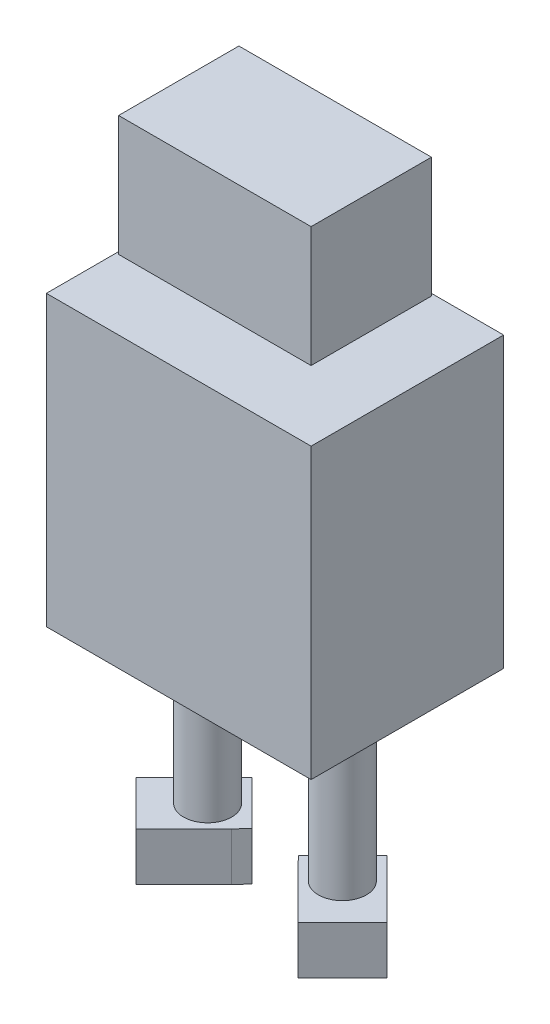
ISO-10303-21;
HEADER;
FILE_DESCRIPTION(('STEP AP214'),'2;1');
FILE_NAME('part.step','',(''),(''),'','','');
FILE_SCHEMA(('AUTOMOTIVE_DESIGN { 1 0 10303 214 1 1 1 1 }'));
ENDSEC;
DATA;
#1=APPLICATION_CONTEXT('core data for automotive mechanical design processes');
#2=APPLICATION_PROTOCOL_DEFINITION('international standard','automotive_design',2000,#1);
#3=PRODUCT_CONTEXT('',#1,'mechanical');
#4=PRODUCT('Part','Part','',(#3));
#5=PRODUCT_RELATED_PRODUCT_CATEGORY('part','',(#4));
#6=PRODUCT_DEFINITION_FORMATION('','',#4);
#7=PRODUCT_DEFINITION_CONTEXT('part definition',#1,'design');
#8=PRODUCT_DEFINITION('design','',#6,#7);
#9=PRODUCT_DEFINITION_SHAPE('','',#8);
#10=(LENGTH_UNIT() NAMED_UNIT(*) SI_UNIT(.MILLI.,.METRE.));
#11=(NAMED_UNIT(*) PLANE_ANGLE_UNIT() SI_UNIT($,.RADIAN.));
#12=(NAMED_UNIT(*) SI_UNIT($,.STERADIAN.) SOLID_ANGLE_UNIT());
#13=UNCERTAINTY_MEASURE_WITH_UNIT(LENGTH_MEASURE(1.E-05),#10,'distance_accuracy_value','');
#14=(GEOMETRIC_REPRESENTATION_CONTEXT(3) GLOBAL_UNCERTAINTY_ASSIGNED_CONTEXT((#13)) GLOBAL_UNIT_ASSIGNED_CONTEXT((#10,
#11,#12)) REPRESENTATION_CONTEXT('',''));
#15=CARTESIAN_POINT('',(0.,0.,0.));
#16=DIRECTION('',(0.,0.,1.));
#17=DIRECTION('',(1.,0.,0.));
#18=AXIS2_PLACEMENT_3D('',#15,#16,#17);
#19=CARTESIAN_POINT('',(-27.5,-30.,40.));
#20=DIRECTION('',(0.,1.,0.));
#21=DIRECTION('',(0.,0.,1.));
#22=AXIS2_PLACEMENT_3D('',#19,#20,#21);
#23=PLANE('',#22);
#24=CARTESIAN_POINT('',(-14.,-30.,20.));
#25=DIRECTION('',(0.,1.,0.));
#26=DIRECTION('',(0.,0.,1.));
#27=AXIS2_PLACEMENT_3D('',#24,#25,#26);
#28=CIRCLE('',#27,5.);
#29=CARTESIAN_POINT('',(-14.,-30.,25.));
#30=VERTEX_POINT('',#29);
#31=EDGE_CURVE('E42',#30,#30,#28,.F.);
#32=ORIENTED_EDGE('',*,*,#31,.F.);
#33=EDGE_LOOP('',(#32));
#34=FACE_BOUND('',#33,.T.);
#35=DIRECTION('',(1.,0.,0.));
#36=VECTOR('',#35,1.);
#37=CARTESIAN_POINT('',(-27.5,-30.,0.));
#38=LINE('',#37,#36);
#39=CARTESIAN_POINT('',(-27.5,-30.,0.));
#40=VERTEX_POINT('',#39);
#41=CARTESIAN_POINT('',(27.5,-30.,0.));
#42=VERTEX_POINT('',#41);
#43=EDGE_CURVE('E74',#40,#42,#38,.T.);
#44=ORIENTED_EDGE('',*,*,#43,.T.);
#45=DIRECTION('',(0.,0.,-1.));
#46=VECTOR('',#45,1.);
#47=CARTESIAN_POINT('',(27.5,-30.,40.));
#48=LINE('',#47,#46);
#49=CARTESIAN_POINT('',(27.5,-30.,40.));
#50=VERTEX_POINT('',#49);
#51=EDGE_CURVE('E297',#50,#42,#48,.T.);
#52=ORIENTED_EDGE('',*,*,#51,.F.);
#53=DIRECTION('',(1.,0.,0.));
#54=VECTOR('',#53,1.);
#55=CARTESIAN_POINT('',(-27.5,-30.,40.));
#56=LINE('',#55,#54);
#57=CARTESIAN_POINT('',(-27.5,-30.,40.));
#58=VERTEX_POINT('',#57);
#59=EDGE_CURVE('E50',#58,#50,#56,.T.);
#60=ORIENTED_EDGE('',*,*,#59,.F.);
#61=DIRECTION('',(0.,0.,-1.));
#62=VECTOR('',#61,1.);
#63=CARTESIAN_POINT('',(-27.5,-30.,40.));
#64=LINE('',#63,#62);
#65=EDGE_CURVE('E305',#58,#40,#64,.T.);
#66=ORIENTED_EDGE('',*,*,#65,.T.);
#67=EDGE_LOOP('',(#44,#52,#60,#66));
#68=FACE_BOUND('',#67,.T.);
#69=CARTESIAN_POINT('',(14.,-30.,20.));
#70=DIRECTION('',(0.,1.,0.));
#71=DIRECTION('',(0.,0.,1.));
#72=AXIS2_PLACEMENT_3D('',#69,#70,#71);
#73=CIRCLE('',#72,5.);
#74=CARTESIAN_POINT('',(14.,-30.,25.));
#75=VERTEX_POINT('',#74);
#76=EDGE_CURVE('E11',#75,#75,#73,.F.);
#77=ORIENTED_EDGE('',*,*,#76,.F.);
#78=EDGE_LOOP('',(#77));
#79=FACE_BOUND('',#78,.T.);
#80=ADVANCED_FACE('F33',(#34,#68,#79),#23,.F.);
#81=CARTESIAN_POINT('',(-27.5,30.,40.));
#82=DIRECTION('',(0.,-1.,0.));
#83=DIRECTION('',(0.,0.,-1.));
#84=AXIS2_PLACEMENT_3D('',#81,#82,#83);
#85=PLANE('',#84);
#86=DIRECTION('',(-1.,0.,0.));
#87=VECTOR('',#86,1.);
#88=CARTESIAN_POINT('',(-27.5,30.,0.));
#89=LINE('',#88,#87);
#90=CARTESIAN_POINT('',(27.5,30.,0.));
#91=VERTEX_POINT('',#90);
#92=CARTESIAN_POINT('',(-27.5,30.,0.));
#93=VERTEX_POINT('',#92);
#94=EDGE_CURVE('E300',#91,#93,#89,.T.);
#95=ORIENTED_EDGE('',*,*,#94,.T.);
#96=DIRECTION('',(0.,0.,-1.));
#97=VECTOR('',#96,1.);
#98=CARTESIAN_POINT('',(-27.5,30.,40.));
#99=LINE('',#98,#97);
#100=CARTESIAN_POINT('',(-27.5,30.,40.));
#101=VERTEX_POINT('',#100);
#102=EDGE_CURVE('E307',#101,#93,#99,.T.);
#103=ORIENTED_EDGE('',*,*,#102,.F.);
#104=DIRECTION('',(-1.,0.,0.));
#105=VECTOR('',#104,1.);
#106=CARTESIAN_POINT('',(-27.5,30.,40.));
#107=LINE('',#106,#105);
#108=CARTESIAN_POINT('',(27.5,30.,40.));
#109=VERTEX_POINT('',#108);
#110=EDGE_CURVE('E82',#109,#101,#107,.T.);
#111=ORIENTED_EDGE('',*,*,#110,.F.);
#112=DIRECTION('',(0.,0.,-1.));
#113=VECTOR('',#112,1.);
#114=CARTESIAN_POINT('',(27.5,30.,40.));
#115=LINE('',#114,#113);
#116=EDGE_CURVE('E309',#109,#91,#115,.T.);
#117=ORIENTED_EDGE('',*,*,#116,.T.);
#118=EDGE_LOOP('',(#95,#103,#111,#117));
#119=FACE_BOUND('',#118,.T.);
#120=CARTESIAN_POINT('',(0.,30.,20.));
#121=DIRECTION('',(0.,-1.,0.));
#122=DIRECTION('',(0.,0.,-1.));
#123=AXIS2_PLACEMENT_3D('',#120,#121,#122);
#124=CIRCLE('',#123,4.);
#125=CARTESIAN_POINT('',(0.,30.,16.));
#126=VERTEX_POINT('',#125);
#127=EDGE_CURVE('E311',#126,#126,#124,.F.);
#128=ORIENTED_EDGE('',*,*,#127,.F.);
#129=EDGE_LOOP('',(#128));
#130=FACE_BOUND('',#129,.T.);
#131=ADVANCED_FACE('F319',(#119,#130),#85,.F.);
#132=CARTESIAN_POINT('',(27.5,-30.,40.));
#133=DIRECTION('',(-1.,0.,0.));
#134=DIRECTION('',(0.,0.,1.));
#135=AXIS2_PLACEMENT_3D('',#132,#133,#134);
#136=PLANE('',#135);
#137=DIRECTION('',(0.,1.,0.));
#138=VECTOR('',#137,1.);
#139=CARTESIAN_POINT('',(27.5,-30.,0.));
#140=LINE('',#139,#138);
#141=EDGE_CURVE('E290',#42,#91,#140,.T.);
#142=ORIENTED_EDGE('',*,*,#141,.T.);
#143=ORIENTED_EDGE('',*,*,#116,.F.);
#144=DIRECTION('',(0.,1.,0.));
#145=VECTOR('',#144,1.);
#146=CARTESIAN_POINT('',(27.5,-30.,40.));
#147=LINE('',#146,#145);
#148=EDGE_CURVE('E291',#50,#109,#147,.T.);
#149=ORIENTED_EDGE('',*,*,#148,.F.);
#150=ORIENTED_EDGE('',*,*,#51,.T.);
#151=EDGE_LOOP('',(#142,#143,#149,#150));
#152=FACE_BOUND('',#151,.T.);
#153=ADVANCED_FACE('F35',(#152),#136,.F.);
#154=CARTESIAN_POINT('',(-27.5,-30.,40.));
#155=DIRECTION('',(1.,0.,0.));
#156=DIRECTION('',(0.,0.,-1.));
#157=AXIS2_PLACEMENT_3D('',#154,#155,#156);
#158=PLANE('',#157);
#159=DIRECTION('',(0.,-1.,0.));
#160=VECTOR('',#159,1.);
#161=CARTESIAN_POINT('',(-27.5,-30.,0.));
#162=LINE('',#161,#160);
#163=EDGE_CURVE('E68',#93,#40,#162,.T.);
#164=ORIENTED_EDGE('',*,*,#163,.T.);
#165=ORIENTED_EDGE('',*,*,#65,.F.);
#166=DIRECTION('',(0.,-1.,0.));
#167=VECTOR('',#166,1.);
#168=CARTESIAN_POINT('',(-27.5,-30.,40.));
#169=LINE('',#168,#167);
#170=EDGE_CURVE('E294',#101,#58,#169,.T.);
#171=ORIENTED_EDGE('',*,*,#170,.F.);
#172=ORIENTED_EDGE('',*,*,#102,.T.);
#173=EDGE_LOOP('',(#164,#165,#171,#172));
#174=FACE_BOUND('',#173,.T.);
#175=ADVANCED_FACE('F374',(#174),#158,.F.);
#176=CARTESIAN_POINT('',(27.5,30.,40.));
#177=DIRECTION('',(0.,0.,-1.));
#178=DIRECTION('',(-1.,0.,0.));
#179=AXIS2_PLACEMENT_3D('',#176,#177,#178);
#180=PLANE('',#179);
#181=ORIENTED_EDGE('',*,*,#148,.T.);
#182=ORIENTED_EDGE('',*,*,#110,.T.);
#183=ORIENTED_EDGE('',*,*,#170,.T.);
#184=ORIENTED_EDGE('',*,*,#59,.T.);
#185=EDGE_LOOP('',(#181,#182,#183,#184));
#186=FACE_BOUND('',#185,.T.);
#187=ADVANCED_FACE('F371',(#186),#180,.F.);
#188=CARTESIAN_POINT('',(27.5,30.,0.));
#189=DIRECTION('',(0.,0.,-1.));
#190=DIRECTION('',(-1.,0.,0.));
#191=AXIS2_PLACEMENT_3D('',#188,#189,#190);
#192=PLANE('',#191);
#193=ORIENTED_EDGE('',*,*,#141,.F.);
#194=ORIENTED_EDGE('',*,*,#43,.F.);
#195=ORIENTED_EDGE('',*,*,#163,.F.);
#196=ORIENTED_EDGE('',*,*,#94,.F.);
#197=EDGE_LOOP('',(#193,#194,#195,#196));
#198=FACE_BOUND('',#197,.T.);
#199=ADVANCED_FACE('F369',(#198),#192,.T.);
#200=CARTESIAN_POINT('',(0.,37.,20.));
#201=DIRECTION('',(0.,-1.,0.));
#202=DIRECTION('',(0.,0.,-1.));
#203=AXIS2_PLACEMENT_3D('',#200,#201,#202);
#204=CYLINDRICAL_SURFACE('',#203,4.);
#205=CARTESIAN_POINT('',(0.,37.,20.));
#206=DIRECTION('',(0.,1.,0.));
#207=DIRECTION('',(0.,0.,1.));
#208=AXIS2_PLACEMENT_3D('',#205,#206,#207);
#209=CIRCLE('',#208,4.);
#210=CARTESIAN_POINT('',(0.,37.,24.));
#211=VERTEX_POINT('',#210);
#212=EDGE_CURVE('E287',#211,#211,#209,.T.);
#213=ORIENTED_EDGE('',*,*,#212,.F.);
#214=EDGE_LOOP('',(#213));
#215=FACE_BOUND('',#214,.T.);
#216=ORIENTED_EDGE('',*,*,#127,.T.);
#217=EDGE_LOOP('',(#216));
#218=FACE_BOUND('',#217,.T.);
#219=ADVANCED_FACE('F351',(#215,#218),#204,.T.);
#220=CARTESIAN_POINT('',(-20.,37.,32.5));
#221=DIRECTION('',(0.,-1.,0.));
#222=DIRECTION('',(0.,0.,-1.));
#223=AXIS2_PLACEMENT_3D('',#220,#221,#222);
#224=PLANE('',#223);
#225=DIRECTION('',(0.,0.,1.));
#226=VECTOR('',#225,1.);
#227=CARTESIAN_POINT('',(-20.,37.,7.50000000000001));
#228=LINE('',#227,#226);
#229=CARTESIAN_POINT('',(-20.,37.,7.50000000000001));
#230=VERTEX_POINT('',#229);
#231=CARTESIAN_POINT('',(-20.,37.,32.5));
#232=VERTEX_POINT('',#231);
#233=EDGE_CURVE('E257',#230,#232,#228,.T.);
#234=ORIENTED_EDGE('',*,*,#233,.F.);
#235=DIRECTION('',(-1.,0.,0.));
#236=VECTOR('',#235,1.);
#237=CARTESIAN_POINT('',(20.,37.,7.50000000000001));
#238=LINE('',#237,#236);
#239=CARTESIAN_POINT('',(20.,37.,7.50000000000001));
#240=VERTEX_POINT('',#239);
#241=EDGE_CURVE('E262',#240,#230,#238,.T.);
#242=ORIENTED_EDGE('',*,*,#241,.F.);
#243=DIRECTION('',(0.,0.,-1.));
#244=VECTOR('',#243,1.);
#245=CARTESIAN_POINT('',(20.,37.,7.50000000000001));
#246=LINE('',#245,#244);
#247=CARTESIAN_POINT('',(20.,37.,32.5));
#248=VERTEX_POINT('',#247);
#249=EDGE_CURVE('E273',#248,#240,#246,.T.);
#250=ORIENTED_EDGE('',*,*,#249,.F.);
#251=DIRECTION('',(1.,0.,0.));
#252=VECTOR('',#251,1.);
#253=CARTESIAN_POINT('',(20.,37.,32.5));
#254=LINE('',#253,#252);
#255=EDGE_CURVE('E271',#232,#248,#254,.T.);
#256=ORIENTED_EDGE('',*,*,#255,.F.);
#257=EDGE_LOOP('',(#234,#242,#250,#256));
#258=FACE_BOUND('',#257,.T.);
#259=ORIENTED_EDGE('',*,*,#212,.T.);
#260=EDGE_LOOP('',(#259));
#261=FACE_BOUND('',#260,.T.);
#262=ADVANCED_FACE('F347',(#258,#261),#224,.T.);
#263=CARTESIAN_POINT('',(-20.,62.,7.50000000000001));
#264=DIRECTION('',(1.,0.,0.));
#265=DIRECTION('',(0.,0.,-1.));
#266=AXIS2_PLACEMENT_3D('',#263,#264,#265);
#267=PLANE('',#266);
#268=ORIENTED_EDGE('',*,*,#233,.T.);
#269=DIRECTION('',(0.,-1.,0.));
#270=VECTOR('',#269,1.);
#271=CARTESIAN_POINT('',(-20.,62.,32.5));
#272=LINE('',#271,#270);
#273=CARTESIAN_POINT('',(-20.,62.,32.5));
#274=VERTEX_POINT('',#273);
#275=EDGE_CURVE('E284',#274,#232,#272,.T.);
#276=ORIENTED_EDGE('',*,*,#275,.F.);
#277=DIRECTION('',(0.,0.,1.));
#278=VECTOR('',#277,1.);
#279=CARTESIAN_POINT('',(-20.,62.,7.50000000000001));
#280=LINE('',#279,#278);
#281=CARTESIAN_POINT('',(-20.,62.,7.50000000000001));
#282=VERTEX_POINT('',#281);
#283=EDGE_CURVE('E258',#282,#274,#280,.T.);
#284=ORIENTED_EDGE('',*,*,#283,.F.);
#285=DIRECTION('',(0.,-1.,0.));
#286=VECTOR('',#285,1.);
#287=CARTESIAN_POINT('',(-20.,62.,7.50000000000001));
#288=LINE('',#287,#286);
#289=EDGE_CURVE('E268',#282,#230,#288,.T.);
#290=ORIENTED_EDGE('',*,*,#289,.T.);
#291=EDGE_LOOP('',(#268,#276,#284,#290));
#292=FACE_BOUND('',#291,.T.);
#293=ADVANCED_FACE('F350',(#292),#267,.F.);
#294=CARTESIAN_POINT('',(20.,62.,32.5));
#295=DIRECTION('',(0.,0.,-1.));
#296=DIRECTION('',(-1.,0.,0.));
#297=AXIS2_PLACEMENT_3D('',#294,#295,#296);
#298=PLANE('',#297);
#299=ORIENTED_EDGE('',*,*,#255,.T.);
#300=DIRECTION('',(0.,-1.,0.));
#301=VECTOR('',#300,1.);
#302=CARTESIAN_POINT('',(20.,62.,32.5));
#303=LINE('',#302,#301);
#304=CARTESIAN_POINT('',(20.,62.,32.5));
#305=VERTEX_POINT('',#304);
#306=EDGE_CURVE('E281',#305,#248,#303,.T.);
#307=ORIENTED_EDGE('',*,*,#306,.F.);
#308=DIRECTION('',(1.,0.,0.));
#309=VECTOR('',#308,1.);
#310=CARTESIAN_POINT('',(20.,62.,32.5));
#311=LINE('',#310,#309);
#312=EDGE_CURVE('E261',#274,#305,#311,.T.);
#313=ORIENTED_EDGE('',*,*,#312,.F.);
#314=ORIENTED_EDGE('',*,*,#275,.T.);
#315=EDGE_LOOP('',(#299,#307,#313,#314));
#316=FACE_BOUND('',#315,.T.);
#317=ADVANCED_FACE('F359',(#316),#298,.F.);
#318=CARTESIAN_POINT('',(20.,62.,7.50000000000001));
#319=DIRECTION('',(-1.,0.,0.));
#320=DIRECTION('',(0.,0.,1.));
#321=AXIS2_PLACEMENT_3D('',#318,#319,#320);
#322=PLANE('',#321);
#323=ORIENTED_EDGE('',*,*,#249,.T.);
#324=DIRECTION('',(0.,-1.,0.));
#325=VECTOR('',#324,1.);
#326=CARTESIAN_POINT('',(20.,62.,7.50000000000001));
#327=LINE('',#326,#325);
#328=CARTESIAN_POINT('',(20.,62.,7.50000000000001));
#329=VERTEX_POINT('',#328);
#330=EDGE_CURVE('E278',#329,#240,#327,.T.);
#331=ORIENTED_EDGE('',*,*,#330,.F.);
#332=DIRECTION('',(0.,0.,-1.));
#333=VECTOR('',#332,1.);
#334=CARTESIAN_POINT('',(20.,62.,7.50000000000001));
#335=LINE('',#334,#333);
#336=EDGE_CURVE('E264',#305,#329,#335,.T.);
#337=ORIENTED_EDGE('',*,*,#336,.F.);
#338=ORIENTED_EDGE('',*,*,#306,.T.);
#339=EDGE_LOOP('',(#323,#331,#337,#338));
#340=FACE_BOUND('',#339,.T.);
#341=ADVANCED_FACE('F355',(#340),#322,.F.);
#342=CARTESIAN_POINT('',(20.,62.,7.50000000000001));
#343=DIRECTION('',(0.,0.,1.));
#344=DIRECTION('',(1.,0.,0.));
#345=AXIS2_PLACEMENT_3D('',#342,#343,#344);
#346=PLANE('',#345);
#347=ORIENTED_EDGE('',*,*,#241,.T.);
#348=ORIENTED_EDGE('',*,*,#289,.F.);
#349=DIRECTION('',(-1.,0.,0.));
#350=VECTOR('',#349,1.);
#351=CARTESIAN_POINT('',(20.,62.,7.50000000000001));
#352=LINE('',#351,#350);
#353=EDGE_CURVE('E266',#329,#282,#352,.T.);
#354=ORIENTED_EDGE('',*,*,#353,.F.);
#355=ORIENTED_EDGE('',*,*,#330,.T.);
#356=EDGE_LOOP('',(#347,#348,#354,#355));
#357=FACE_BOUND('',#356,.T.);
#358=ADVANCED_FACE('F345',(#357),#346,.F.);
#359=CARTESIAN_POINT('',(-20.,62.,32.5));
#360=DIRECTION('',(0.,-1.,0.));
#361=DIRECTION('',(0.,0.,-1.));
#362=AXIS2_PLACEMENT_3D('',#359,#360,#361);
#363=PLANE('',#362);
#364=ORIENTED_EDGE('',*,*,#283,.T.);
#365=ORIENTED_EDGE('',*,*,#312,.T.);
#366=ORIENTED_EDGE('',*,*,#336,.T.);
#367=ORIENTED_EDGE('',*,*,#353,.T.);
#368=EDGE_LOOP('',(#364,#365,#366,#367));
#369=FACE_BOUND('',#368,.T.);
#370=ADVANCED_FACE('F336',(#369),#363,.F.);
#371=CARTESIAN_POINT('',(-14.,-65.,20.));
#372=DIRECTION('',(0.,1.,0.));
#373=DIRECTION('',(0.,0.,1.));
#374=AXIS2_PLACEMENT_3D('',#371,#372,#373);
#375=CYLINDRICAL_SURFACE('',#374,5.);
#376=CARTESIAN_POINT('',(-14.,-65.,20.));
#377=DIRECTION('',(0.,-1.,0.));
#378=DIRECTION('',(0.,0.,-1.));
#379=AXIS2_PLACEMENT_3D('',#376,#377,#378);
#380=CIRCLE('',#379,5.);
#381=CARTESIAN_POINT('',(-14.,-65.,15.));
#382=VERTEX_POINT('',#381);
#383=EDGE_CURVE('E254',#382,#382,#380,.T.);
#384=ORIENTED_EDGE('',*,*,#383,.F.);
#385=EDGE_LOOP('',(#384));
#386=FACE_BOUND('',#385,.T.);
#387=ORIENTED_EDGE('',*,*,#31,.T.);
#388=EDGE_LOOP('',(#387));
#389=FACE_BOUND('',#388,.T.);
#390=ADVANCED_FACE('F316',(#386,#389),#375,.T.);
#391=CARTESIAN_POINT('',(14.,-65.,20.));
#392=DIRECTION('',(0.,1.,0.));
#393=DIRECTION('',(0.,0.,1.));
#394=AXIS2_PLACEMENT_3D('',#391,#392,#393);
#395=CYLINDRICAL_SURFACE('',#394,5.);
#396=CARTESIAN_POINT('',(14.,-65.,20.));
#397=DIRECTION('',(0.,-1.,0.));
#398=DIRECTION('',(0.,0.,1.));
#399=AXIS2_PLACEMENT_3D('',#396,#397,#398);
#400=CIRCLE('',#399,5.);
#401=CARTESIAN_POINT('',(14.,-65.,25.));
#402=VERTEX_POINT('',#401);
#403=EDGE_CURVE('E251',#402,#402,#400,.T.);
#404=ORIENTED_EDGE('',*,*,#403,.F.);
#405=EDGE_LOOP('',(#404));
#406=FACE_BOUND('',#405,.T.);
#407=ORIENTED_EDGE('',*,*,#76,.T.);
#408=EDGE_LOOP('',(#407));
#409=FACE_BOUND('',#408,.T.);
#410=ADVANCED_FACE('F324',(#406,#409),#395,.T.);
#411=CARTESIAN_POINT('',(-26.0804030524489,-65.,22.8284271247462));
#412=DIRECTION('',(0.,-1.,0.));
#413=DIRECTION('',(0.,0.,-1.));
#414=AXIS2_PLACEMENT_3D('',#411,#412,#413);
#415=PLANE('',#414);
#416=DIRECTION('',(-0.707106781186546,0.,-0.707106781186549));
#417=VECTOR('',#416,1.);
#418=CARTESIAN_POINT('',(-23.9590827088893,-65.,24.9497474683058));
#419=LINE('',#418,#417);
#420=CARTESIAN_POINT('',(-16.8377623653296,-65.,32.0710678118655));
#421=VERTEX_POINT('',#420);
#422=CARTESIAN_POINT('',(-26.0804030524489,-65.,22.8284271247462));
#423=VERTEX_POINT('',#422);
#424=EDGE_CURVE('E179',#421,#423,#419,.T.);
#425=ORIENTED_EDGE('',*,*,#424,.F.);
#426=DIRECTION('',(0.707106781186548,0.,-0.707106781186547));
#427=VECTOR('',#426,1.);
#428=CARTESIAN_POINT('',(-16.8377623653296,-65.,32.0710678118655));
#429=LINE('',#428,#427);
#430=CARTESIAN_POINT('',(-6.88801489702381,-65.,22.1213203435596));
#431=VERTEX_POINT('',#430);
#432=EDGE_CURVE('E217',#421,#431,#429,.T.);
#433=ORIENTED_EDGE('',*,*,#432,.T.);
#434=DIRECTION('',(-0.68585509245863,0.,0.727738134323442));
#435=VECTOR('',#434,1.);
#436=CARTESIAN_POINT('',(-4.82954668594094,-65.,19.9371478675232));
#437=LINE('',#436,#435);
#438=CARTESIAN_POINT('',(-4.82954668594094,-65.,19.9371478675232));
#439=VERTEX_POINT('',#438);
#440=EDGE_CURVE('E233',#439,#431,#437,.T.);
#441=ORIENTED_EDGE('',*,*,#440,.F.);
#442=DIRECTION('',(0.707106781186551,0.,0.707106781186544));
#443=VECTOR('',#442,1.);
#444=CARTESIAN_POINT('',(-6.88801489702381,-65.,17.8786796564404));
#445=LINE('',#444,#443);
#446=CARTESIAN_POINT('',(-14.0093352405835,-65.,10.7573593128807));
#447=VERTEX_POINT('',#446);
#448=EDGE_CURVE('E231',#447,#439,#445,.T.);
#449=ORIENTED_EDGE('',*,*,#448,.F.);
#450=DIRECTION('',(-0.707106781186547,0.,0.707106781186548));
#451=VECTOR('',#450,1.);
#452=CARTESIAN_POINT('',(-14.0093352405835,-65.,10.7573593128807));
#453=LINE('',#452,#451);
#454=EDGE_CURVE('E229',#447,#423,#453,.T.);
#455=ORIENTED_EDGE('',*,*,#454,.T.);
#456=EDGE_LOOP('',(#425,#433,#441,#449,#455));
#457=FACE_BOUND('',#456,.T.);
#458=ORIENTED_EDGE('',*,*,#383,.T.);
#459=EDGE_LOOP('',(#458));
#460=FACE_BOUND('',#459,.T.);
#461=ADVANCED_FACE('F326',(#457,#460),#415,.F.);
#462=CARTESIAN_POINT('',(-23.9590827088893,-75.,24.9497474683058));
#463=DIRECTION('',(0.707106781186549,0.,-0.707106781186546));
#464=DIRECTION('',(-0.707106781186546,0.,-0.707106781186549));
#465=AXIS2_PLACEMENT_3D('',#462,#463,#464);
#466=PLANE('',#465);
#467=ORIENTED_EDGE('',*,*,#424,.T.);
#468=DIRECTION('',(0.,1.,0.));
#469=VECTOR('',#468,1.);
#470=CARTESIAN_POINT('',(-26.0804030524489,-75.,22.8284271247462));
#471=LINE('',#470,#469);
#472=CARTESIAN_POINT('',(-26.0804030524489,-75.,22.8284271247462));
#473=VERTEX_POINT('',#472);
#474=EDGE_CURVE('E248',#473,#423,#471,.T.);
#475=ORIENTED_EDGE('',*,*,#474,.F.);
#476=DIRECTION('',(-0.707106781186549,0.,-0.707106781186546));
#477=VECTOR('',#476,1.);
#478=CARTESIAN_POINT('',(-16.8377623653296,-75.,32.0710678118655));
#479=LINE('',#478,#477);
#480=CARTESIAN_POINT('',(-16.8377623653296,-75.,32.0710678118655));
#481=VERTEX_POINT('',#480);
#482=EDGE_CURVE('E214',#481,#473,#479,.T.);
#483=ORIENTED_EDGE('',*,*,#482,.F.);
#484=DIRECTION('',(0.,1.,0.));
#485=VECTOR('',#484,1.);
#486=CARTESIAN_POINT('',(-16.8377623653296,-75.,32.0710678118655));
#487=LINE('',#486,#485);
#488=EDGE_CURVE('E226',#481,#421,#487,.T.);
#489=ORIENTED_EDGE('',*,*,#488,.T.);
#490=EDGE_LOOP('',(#467,#475,#483,#489));
#491=FACE_BOUND('',#490,.T.);
#492=ADVANCED_FACE('F333',(#491),#466,.F.);
#493=CARTESIAN_POINT('',(-14.0093352405835,-75.,10.7573593128807));
#494=DIRECTION('',(-0.707106781186548,0.,-0.707106781186547));
#495=DIRECTION('',(-0.707106781186547,0.,0.707106781186548));
#496=AXIS2_PLACEMENT_3D('',#493,#494,#495);
#497=PLANE('',#496);
#498=ORIENTED_EDGE('',*,*,#454,.F.);
#499=DIRECTION('',(0.,1.,0.));
#500=VECTOR('',#499,1.);
#501=CARTESIAN_POINT('',(-14.0093352405835,-75.,10.7573593128807));
#502=LINE('',#501,#500);
#503=CARTESIAN_POINT('',(-14.0093352405835,-75.,10.7573593128807));
#504=VERTEX_POINT('',#503);
#505=EDGE_CURVE('E245',#504,#447,#502,.T.);
#506=ORIENTED_EDGE('',*,*,#505,.F.);
#507=DIRECTION('',(0.707106781186547,0.,-0.707106781186548));
#508=VECTOR('',#507,1.);
#509=CARTESIAN_POINT('',(-26.0804030524489,-75.,22.8284271247462));
#510=LINE('',#509,#508);
#511=EDGE_CURVE('E216',#473,#504,#510,.T.);
#512=ORIENTED_EDGE('',*,*,#511,.F.);
#513=ORIENTED_EDGE('',*,*,#474,.T.);
#514=EDGE_LOOP('',(#498,#506,#512,#513));
#515=FACE_BOUND('',#514,.T.);
#516=ADVANCED_FACE('F460',(#515),#497,.T.);
#517=CARTESIAN_POINT('',(-6.88801489702381,-75.,17.8786796564404));
#518=DIRECTION('',(-0.707106781186544,0.,0.707106781186551));
#519=DIRECTION('',(0.707106781186551,0.,0.707106781186544));
#520=AXIS2_PLACEMENT_3D('',#517,#518,#519);
#521=PLANE('',#520);
#522=ORIENTED_EDGE('',*,*,#448,.T.);
#523=DIRECTION('',(0.,1.,0.));
#524=VECTOR('',#523,1.);
#525=CARTESIAN_POINT('',(-4.82954668594094,-75.,19.9371478675232));
#526=LINE('',#525,#524);
#527=CARTESIAN_POINT('',(-4.82954668594094,-75.,19.9371478675232));
#528=VERTEX_POINT('',#527);
#529=EDGE_CURVE('E242',#528,#439,#526,.T.);
#530=ORIENTED_EDGE('',*,*,#529,.F.);
#531=DIRECTION('',(-0.707106781186548,0.,-0.707106781186547));
#532=VECTOR('',#531,1.);
#533=CARTESIAN_POINT('',(-11.8880148970238,-75.,12.8786796564404));
#534=LINE('',#533,#532);
#535=EDGE_CURVE('E219',#528,#504,#534,.T.);
#536=ORIENTED_EDGE('',*,*,#535,.T.);
#537=ORIENTED_EDGE('',*,*,#505,.T.);
#538=EDGE_LOOP('',(#522,#530,#536,#537));
#539=FACE_BOUND('',#538,.T.);
#540=ADVANCED_FACE('F471',(#539),#521,.F.);
#541=CARTESIAN_POINT('',(-4.82954668594094,-75.,19.9371478675232));
#542=DIRECTION('',(-0.727738134323442,0.,-0.68585509245863));
#543=DIRECTION('',(-0.68585509245863,0.,0.727738134323442));
#544=AXIS2_PLACEMENT_3D('',#541,#542,#543);
#545=PLANE('',#544);
#546=ORIENTED_EDGE('',*,*,#440,.T.);
#547=DIRECTION('',(0.,1.,0.));
#548=VECTOR('',#547,1.);
#549=CARTESIAN_POINT('',(-6.88801489702381,-75.,22.1213203435596));
#550=LINE('',#549,#548);
#551=CARTESIAN_POINT('',(-6.88801489702381,-75.,22.1213203435596));
#552=VERTEX_POINT('',#551);
#553=EDGE_CURVE('E239',#552,#431,#550,.T.);
#554=ORIENTED_EDGE('',*,*,#553,.F.);
#555=DIRECTION('',(-0.68585509245863,0.,0.727738134323442));
#556=VECTOR('',#555,1.);
#557=CARTESIAN_POINT('',(-4.82954668594094,-75.,19.9371478675232));
#558=LINE('',#557,#556);
#559=EDGE_CURVE('E222',#528,#552,#558,.T.);
#560=ORIENTED_EDGE('',*,*,#559,.F.);
#561=ORIENTED_EDGE('',*,*,#529,.T.);
#562=EDGE_LOOP('',(#546,#554,#560,#561));
#563=FACE_BOUND('',#562,.T.);
#564=ADVANCED_FACE('F482',(#563),#545,.F.);
#565=CARTESIAN_POINT('',(-16.8377623653296,-75.,32.0710678118655));
#566=DIRECTION('',(0.707106781186547,0.,0.707106781186548));
#567=DIRECTION('',(0.707106781186548,0.,-0.707106781186547));
#568=AXIS2_PLACEMENT_3D('',#565,#566,#567);
#569=PLANE('',#568);
#570=ORIENTED_EDGE('',*,*,#432,.F.);
#571=ORIENTED_EDGE('',*,*,#488,.F.);
#572=DIRECTION('',(-0.707106781186548,0.,0.707106781186548));
#573=VECTOR('',#572,1.);
#574=CARTESIAN_POINT('',(-6.88801489702381,-75.,22.1213203435596));
#575=LINE('',#574,#573);
#576=EDGE_CURVE('E224',#552,#481,#575,.T.);
#577=ORIENTED_EDGE('',*,*,#576,.F.);
#578=ORIENTED_EDGE('',*,*,#553,.T.);
#579=EDGE_LOOP('',(#570,#571,#577,#578));
#580=FACE_BOUND('',#579,.T.);
#581=ADVANCED_FACE('F493',(#580),#569,.T.);
#582=CARTESIAN_POINT('',(-26.0804030524489,-75.,22.8284271247462));
#583=DIRECTION('',(0.,-1.,0.));
#584=DIRECTION('',(0.,0.,-1.));
#585=AXIS2_PLACEMENT_3D('',#582,#583,#584);
#586=PLANE('',#585);
#587=ORIENTED_EDGE('',*,*,#482,.T.);
#588=ORIENTED_EDGE('',*,*,#511,.T.);
#589=ORIENTED_EDGE('',*,*,#535,.F.);
#590=ORIENTED_EDGE('',*,*,#559,.T.);
#591=ORIENTED_EDGE('',*,*,#576,.T.);
#592=EDGE_LOOP('',(#587,#588,#589,#590,#591));
#593=FACE_BOUND('',#592,.T.);
#594=ADVANCED_FACE('F504',(#593),#586,.T.);
#595=CARTESIAN_POINT('',(16.8284271247462,-65.,32.0710678118655));
#596=DIRECTION('',(0.,1.,0.));
#597=DIRECTION('',(0.,0.,1.));
#598=AXIS2_PLACEMENT_3D('',#595,#596,#597);
#599=PLANE('',#598);
#600=DIRECTION('',(0.68585509245863,0.,0.727738134323442));
#601=VECTOR('',#600,1.);
#602=CARTESIAN_POINT('',(4.82021144535749,-65.,19.9371478675232));
#603=LINE('',#602,#601);
#604=CARTESIAN_POINT('',(4.82021144535749,-65.,19.9371478675232));
#605=VERTEX_POINT('',#604);
#606=CARTESIAN_POINT('',(6.87867965644036,-65.,22.1213203435596));
#607=VERTEX_POINT('',#606);
#608=EDGE_CURVE('E187',#605,#607,#603,.T.);
#609=ORIENTED_EDGE('',*,*,#608,.T.);
#610=DIRECTION('',(-0.707106781186548,0.,-0.707106781186547));
#611=VECTOR('',#610,1.);
#612=CARTESIAN_POINT('',(16.8284271247462,-65.,32.0710678118655));
#613=LINE('',#612,#611);
#614=CARTESIAN_POINT('',(16.8284271247462,-65.,32.0710678118655));
#615=VERTEX_POINT('',#614);
#616=EDGE_CURVE('E169',#615,#607,#613,.T.);
#617=ORIENTED_EDGE('',*,*,#616,.F.);
#618=DIRECTION('',(0.707106781186547,0.,-0.707106781186548));
#619=VECTOR('',#618,1.);
#620=CARTESIAN_POINT('',(23.9497474683058,-65.,24.9497474683058));
#621=LINE('',#620,#619);
#622=CARTESIAN_POINT('',(26.0710678118655,-65.,22.8284271247462));
#623=VERTEX_POINT('',#622);
#624=EDGE_CURVE('E180',#615,#623,#621,.T.);
#625=ORIENTED_EDGE('',*,*,#624,.T.);
#626=DIRECTION('',(0.707106781186548,0.,0.707106781186547));
#627=VECTOR('',#626,1.);
#628=CARTESIAN_POINT('',(14.,-65.,10.7573593128807));
#629=LINE('',#628,#627);
#630=CARTESIAN_POINT('',(14.,-65.,10.7573593128807));
#631=VERTEX_POINT('',#630);
#632=EDGE_CURVE('E199',#631,#623,#629,.T.);
#633=ORIENTED_EDGE('',*,*,#632,.F.);
#634=DIRECTION('',(-0.707106781186551,0.,0.707106781186544));
#635=VECTOR('',#634,1.);
#636=CARTESIAN_POINT('',(6.87867965644036,-65.,17.8786796564404));
#637=LINE('',#636,#635);
#638=EDGE_CURVE('E196',#631,#605,#637,.T.);
#639=ORIENTED_EDGE('',*,*,#638,.T.);
#640=EDGE_LOOP('',(#609,#617,#625,#633,#639));
#641=FACE_BOUND('',#640,.T.);
#642=ORIENTED_EDGE('',*,*,#403,.T.);
#643=EDGE_LOOP('',(#642));
#644=FACE_BOUND('',#643,.T.);
#645=ADVANCED_FACE('F193',(#641,#644),#599,.T.);
#646=CARTESIAN_POINT('',(4.82021144535749,-75.,19.9371478675232));
#647=DIRECTION('',(-0.727738134323442,0.,0.68585509245863));
#648=DIRECTION('',(0.68585509245863,0.,0.727738134323442));
#649=AXIS2_PLACEMENT_3D('',#646,#647,#648);
#650=PLANE('',#649);
#651=ORIENTED_EDGE('',*,*,#608,.F.);
#652=DIRECTION('',(0.,1.,0.));
#653=VECTOR('',#652,1.);
#654=CARTESIAN_POINT('',(4.82021144535749,-75.,19.9371478675232));
#655=LINE('',#654,#653);
#656=CARTESIAN_POINT('',(4.82021144535749,-75.,19.9371478675232));
#657=VERTEX_POINT('',#656);
#658=EDGE_CURVE('E190',#657,#605,#655,.T.);
#659=ORIENTED_EDGE('',*,*,#658,.F.);
#660=DIRECTION('',(0.68585509245863,0.,0.727738134323442));
#661=VECTOR('',#660,1.);
#662=CARTESIAN_POINT('',(4.82021144535749,-75.,19.9371478675232));
#663=LINE('',#662,#661);
#664=CARTESIAN_POINT('',(6.87867965644036,-75.,22.1213203435596));
#665=VERTEX_POINT('',#664);
#666=EDGE_CURVE('E189',#657,#665,#663,.T.);
#667=ORIENTED_EDGE('',*,*,#666,.T.);
#668=DIRECTION('',(0.,1.,0.));
#669=VECTOR('',#668,1.);
#670=CARTESIAN_POINT('',(6.87867965644036,-75.,22.1213203435596));
#671=LINE('',#670,#669);
#672=EDGE_CURVE('E172',#665,#607,#671,.T.);
#673=ORIENTED_EDGE('',*,*,#672,.T.);
#674=EDGE_LOOP('',(#651,#659,#667,#673));
#675=FACE_BOUND('',#674,.T.);
#676=ADVANCED_FACE('F185',(#675),#650,.T.);
#677=CARTESIAN_POINT('',(6.87867965644036,-75.,17.8786796564404));
#678=DIRECTION('',(-0.707106781186544,0.,-0.707106781186551));
#679=DIRECTION('',(-0.707106781186551,0.,0.707106781186544));
#680=AXIS2_PLACEMENT_3D('',#677,#678,#679);
#681=PLANE('',#680);
#682=ORIENTED_EDGE('',*,*,#638,.F.);
#683=DIRECTION('',(0.,1.,0.));
#684=VECTOR('',#683,1.);
#685=CARTESIAN_POINT('',(14.,-75.,10.7573593128807));
#686=LINE('',#685,#684);
#687=CARTESIAN_POINT('',(14.,-75.,10.7573593128807));
#688=VERTEX_POINT('',#687);
#689=EDGE_CURVE('E595',#688,#631,#686,.T.);
#690=ORIENTED_EDGE('',*,*,#689,.F.);
#691=DIRECTION('',(0.707106781186548,0.,-0.707106781186547));
#692=VECTOR('',#691,1.);
#693=CARTESIAN_POINT('',(11.8786796564404,-75.,12.8786796564404));
#694=LINE('',#693,#692);
#695=EDGE_CURVE('E208',#657,#688,#694,.T.);
#696=ORIENTED_EDGE('',*,*,#695,.F.);
#697=ORIENTED_EDGE('',*,*,#658,.T.);
#698=EDGE_LOOP('',(#682,#690,#696,#697));
#699=FACE_BOUND('',#698,.T.);
#700=ADVANCED_FACE('F531',(#699),#681,.T.);
#701=CARTESIAN_POINT('',(14.,-75.,10.7573593128807));
#702=DIRECTION('',(-0.707106781186547,0.,0.707106781186548));
#703=DIRECTION('',(0.707106781186548,0.,0.707106781186547));
#704=AXIS2_PLACEMENT_3D('',#701,#702,#703);
#705=PLANE('',#704);
#706=ORIENTED_EDGE('',*,*,#632,.T.);
#707=DIRECTION('',(0.,1.,0.));
#708=VECTOR('',#707,1.);
#709=CARTESIAN_POINT('',(26.0710678118655,-75.,22.8284271247462));
#710=LINE('',#709,#708);
#711=CARTESIAN_POINT('',(26.0710678118655,-75.,22.8284271247462));
#712=VERTEX_POINT('',#711);
#713=EDGE_CURVE('E593',#712,#623,#710,.T.);
#714=ORIENTED_EDGE('',*,*,#713,.F.);
#715=DIRECTION('',(-0.707106781186547,0.,-0.707106781186548));
#716=VECTOR('',#715,1.);
#717=CARTESIAN_POINT('',(26.0710678118655,-75.,22.8284271247462));
#718=LINE('',#717,#716);
#719=EDGE_CURVE('E211',#712,#688,#718,.T.);
#720=ORIENTED_EDGE('',*,*,#719,.T.);
#721=ORIENTED_EDGE('',*,*,#689,.T.);
#722=EDGE_LOOP('',(#706,#714,#720,#721));
#723=FACE_BOUND('',#722,.T.);
#724=ADVANCED_FACE('F541',(#723),#705,.F.);
#725=CARTESIAN_POINT('',(23.9497474683058,-75.,24.9497474683058));
#726=DIRECTION('',(0.707106781186548,0.,0.707106781186547));
#727=DIRECTION('',(0.707106781186547,0.,-0.707106781186548));
#728=AXIS2_PLACEMENT_3D('',#725,#726,#727);
#729=PLANE('',#728);
#730=ORIENTED_EDGE('',*,*,#624,.F.);
#731=DIRECTION('',(0.,1.,0.));
#732=VECTOR('',#731,1.);
#733=CARTESIAN_POINT('',(16.8284271247462,-75.,32.0710678118655));
#734=LINE('',#733,#732);
#735=CARTESIAN_POINT('',(16.8284271247462,-75.,32.0710678118655));
#736=VERTEX_POINT('',#735);
#737=EDGE_CURVE('E175',#736,#615,#734,.T.);
#738=ORIENTED_EDGE('',*,*,#737,.F.);
#739=DIRECTION('',(0.707106781186549,0.,-0.707106781186546));
#740=VECTOR('',#739,1.);
#741=CARTESIAN_POINT('',(16.8284271247462,-75.,32.0710678118655));
#742=LINE('',#741,#740);
#743=EDGE_CURVE('E201',#736,#712,#742,.T.);
#744=ORIENTED_EDGE('',*,*,#743,.T.);
#745=ORIENTED_EDGE('',*,*,#713,.T.);
#746=EDGE_LOOP('',(#730,#738,#744,#745));
#747=FACE_BOUND('',#746,.T.);
#748=ADVANCED_FACE('F553',(#747),#729,.T.);
#749=CARTESIAN_POINT('',(16.8284271247462,-75.,32.0710678118655));
#750=DIRECTION('',(0.707106781186547,0.,-0.707106781186548));
#751=DIRECTION('',(-0.707106781186548,0.,-0.707106781186547));
#752=AXIS2_PLACEMENT_3D('',#749,#750,#751);
#753=PLANE('',#752);
#754=ORIENTED_EDGE('',*,*,#616,.T.);
#755=ORIENTED_EDGE('',*,*,#672,.F.);
#756=DIRECTION('',(0.707106781186548,0.,0.707106781186548));
#757=VECTOR('',#756,1.);
#758=CARTESIAN_POINT('',(6.87867965644036,-75.,22.1213203435596));
#759=LINE('',#758,#757);
#760=EDGE_CURVE('E197',#665,#736,#759,.T.);
#761=ORIENTED_EDGE('',*,*,#760,.T.);
#762=ORIENTED_EDGE('',*,*,#737,.T.);
#763=EDGE_LOOP('',(#754,#755,#761,#762));
#764=FACE_BOUND('',#763,.T.);
#765=ADVANCED_FACE('F171',(#764),#753,.F.);
#766=CARTESIAN_POINT('',(16.8284271247462,-75.,32.0710678118655));
#767=DIRECTION('',(0.,1.,0.));
#768=DIRECTION('',(0.,0.,1.));
#769=AXIS2_PLACEMENT_3D('',#766,#767,#768);
#770=PLANE('',#769);
#771=ORIENTED_EDGE('',*,*,#760,.F.);
#772=ORIENTED_EDGE('',*,*,#666,.F.);
#773=ORIENTED_EDGE('',*,*,#695,.T.);
#774=ORIENTED_EDGE('',*,*,#719,.F.);
#775=ORIENTED_EDGE('',*,*,#743,.F.);
#776=EDGE_LOOP('',(#771,#772,#773,#774,#775));
#777=FACE_BOUND('',#776,.T.);
#778=ADVANCED_FACE('F576',(#777),#770,.F.);
#779=CLOSED_SHELL('',(#80,#131,#153,#175,#187,#199,#219,#262,#293,#317,#341,#358,#370,#390,#410,
#461,#492,#516,#540,#564,#581,#594,#645,#676,#700,#724,#748,#765,#778));
#780=MANIFOLD_SOLID_BREP('B2',#779);
#781=ADVANCED_BREP_SHAPE_REPRESENTATION('',(#18,#780),#14);
#782=SHAPE_DEFINITION_REPRESENTATION(#9,#781);
ENDSEC;
END-ISO-10303-21;
